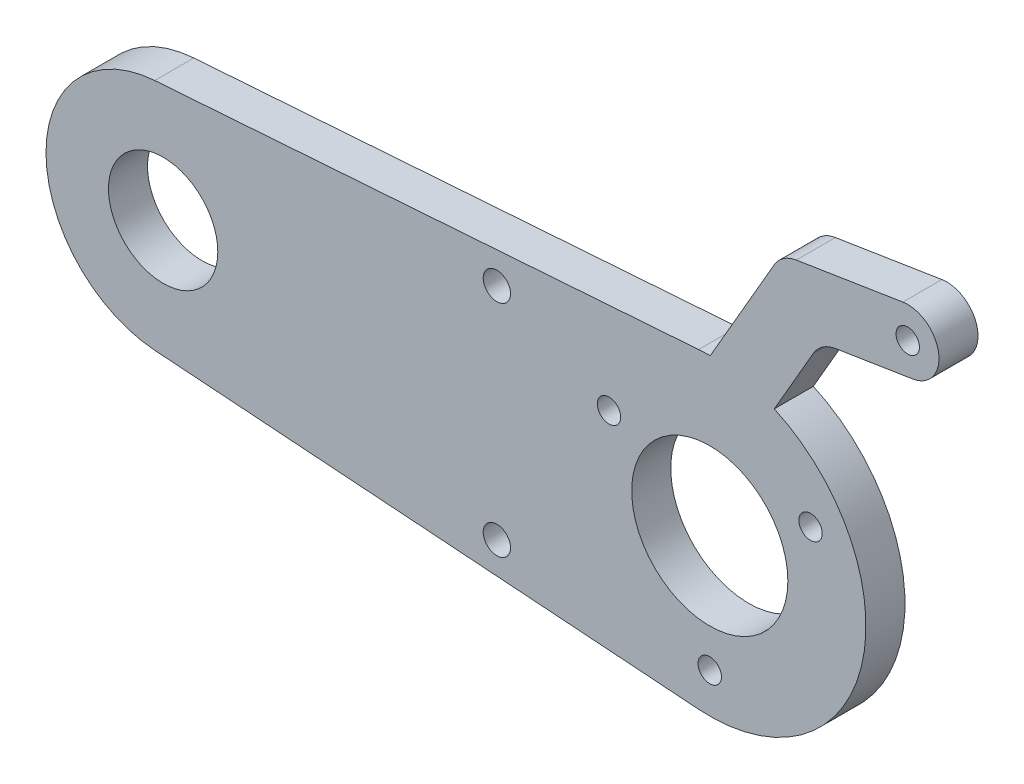
ISO-10303-21;
HEADER;
FILE_DESCRIPTION(('STEP AP214'),'2;1');
FILE_NAME('part.step','',(''),(''),'','','');
FILE_SCHEMA(('AUTOMOTIVE_DESIGN { 1 0 10303 214 1 1 1 1 }'));
ENDSEC;
DATA;
#1=APPLICATION_CONTEXT('core data for automotive mechanical design processes');
#2=APPLICATION_PROTOCOL_DEFINITION('international standard','automotive_design',2000,#1);
#3=PRODUCT_CONTEXT('',#1,'mechanical');
#4=PRODUCT('Part','Part','',(#3));
#5=PRODUCT_RELATED_PRODUCT_CATEGORY('part','',(#4));
#6=PRODUCT_DEFINITION_FORMATION('','',#4);
#7=PRODUCT_DEFINITION_CONTEXT('part definition',#1,'design');
#8=PRODUCT_DEFINITION('design','',#6,#7);
#9=PRODUCT_DEFINITION_SHAPE('','',#8);
#10=(LENGTH_UNIT() NAMED_UNIT(*) SI_UNIT(.MILLI.,.METRE.));
#11=(NAMED_UNIT(*) PLANE_ANGLE_UNIT() SI_UNIT($,.RADIAN.));
#12=(NAMED_UNIT(*) SI_UNIT($,.STERADIAN.) SOLID_ANGLE_UNIT());
#13=UNCERTAINTY_MEASURE_WITH_UNIT(LENGTH_MEASURE(1.E-05),#10,'distance_accuracy_value','');
#14=(GEOMETRIC_REPRESENTATION_CONTEXT(3) GLOBAL_UNCERTAINTY_ASSIGNED_CONTEXT((#13)) GLOBAL_UNIT_ASSIGNED_CONTEXT((#10,
#11,#12)) REPRESENTATION_CONTEXT('',''));
#15=CARTESIAN_POINT('',(0.,0.,0.));
#16=DIRECTION('',(0.,0.,1.));
#17=DIRECTION('',(1.,0.,0.));
#18=AXIS2_PLACEMENT_3D('',#15,#16,#17);
#19=CARTESIAN_POINT('',(0.,0.,-5.));
#20=DIRECTION('',(0.,0.,1.));
#21=DIRECTION('',(-1.,0.,0.));
#22=AXIS2_PLACEMENT_3D('',#19,#20,#21);
#23=PLANE('',#22);
#24=CARTESIAN_POINT('',(0.,0.,-5.));
#25=DIRECTION('',(0.,0.,1.));
#26=DIRECTION('',(-1.,0.,0.));
#27=AXIS2_PLACEMENT_3D('',#24,#25,#26);
#28=CIRCLE('',#27,20.);
#29=CARTESIAN_POINT('',(-1.42857142857143,-19.9489143482413,-5.));
#30=VERTEX_POINT('',#29);
#31=CARTESIAN_POINT('',(8.26328421639514,18.2131308115622,-5.));
#32=VERTEX_POINT('',#31);
#33=EDGE_CURVE('E189',#30,#32,#28,.T.);
#34=ORIENTED_EDGE('',*,*,#33,.F.);
#35=DIRECTION('',(0.997445717412067,-0.0714285714285714,0.));
#36=VECTOR('',#35,1.);
#37=CARTESIAN_POINT('',(-71.0714285714286,-14.961685761181,-5.));
#38=LINE('',#37,#36);
#39=CARTESIAN_POINT('',(-71.0714285714286,-14.961685761181,-5.));
#40=VERTEX_POINT('',#39);
#41=EDGE_CURVE('E151',#40,#30,#38,.T.);
#42=ORIENTED_EDGE('',*,*,#41,.F.);
#43=CARTESIAN_POINT('',(-70.,0.,-5.));
#44=DIRECTION('',(0.,0.,1.));
#45=DIRECTION('',(-1.,0.,0.));
#46=AXIS2_PLACEMENT_3D('',#43,#44,#45);
#47=CIRCLE('',#46,15.);
#48=CARTESIAN_POINT('',(-71.0714285714286,14.961685761181,-5.));
#49=VERTEX_POINT('',#48);
#50=EDGE_CURVE('E132',#49,#40,#47,.T.);
#51=ORIENTED_EDGE('',*,*,#50,.F.);
#52=DIRECTION('',(-0.997445717412067,-0.0714285714285714,0.));
#53=VECTOR('',#52,1.);
#54=CARTESIAN_POINT('',(-71.0714285714286,14.961685761181,-5.));
#55=LINE('',#54,#53);
#56=CARTESIAN_POINT('',(-1.42857142857143,19.9489143482413,-5.));
#57=VERTEX_POINT('',#56);
#58=EDGE_CURVE('E142',#57,#49,#55,.T.);
#59=ORIENTED_EDGE('',*,*,#58,.F.);
#60=CARTESIAN_POINT('',(0.,0.,-5.));
#61=DIRECTION('',(0.,0.,1.));
#62=DIRECTION('',(1.,0.,0.));
#63=AXIS2_PLACEMENT_3D('',#60,#61,#62);
#64=CIRCLE('',#63,20.);
#65=CARTESIAN_POINT('',(0.0572819558484061,19.9999179692701,-5.));
#66=VERTEX_POINT('',#65);
#67=EDGE_CURVE('E147',#66,#57,#64,.T.);
#68=ORIENTED_EDGE('',*,*,#67,.F.);
#69=DIRECTION('',(-0.499999999999994,-0.866025403784442,0.));
#70=VECTOR('',#69,1.);
#71=CARTESIAN_POINT('',(8.24298311691214,34.1779682758083,-5.));
#72=LINE('',#71,#70);
#73=CARTESIAN_POINT('',(8.24298311691214,34.1779682758083,-5.));
#74=VERTEX_POINT('',#73);
#75=EDGE_CURVE('E235',#74,#66,#72,.T.);
#76=ORIENTED_EDGE('',*,*,#75,.F.);
#77=CARTESIAN_POINT('',(11.7070847320499,32.1779682758083,-5.));
#78=DIRECTION('',(0.,0.,1.));
#79=DIRECTION('',(-1.,0.,0.));
#80=AXIS2_PLACEMENT_3D('',#77,#78,#79);
#81=CIRCLE('',#80,3.99999999999999);
#82=CARTESIAN_POINT('',(11.0813468718889,36.1287216381888,-5.));
#83=VERTEX_POINT('',#82);
#84=EDGE_CURVE('E232',#83,#74,#81,.T.);
#85=ORIENTED_EDGE('',*,*,#84,.F.);
#86=DIRECTION('',(-0.987688340595136,-0.156434465040244,0.));
#87=VECTOR('',#86,1.);
#88=CARTESIAN_POINT('',(11.0813468718889,36.1287216381888,-5.));
#89=LINE('',#88,#87);
#90=CARTESIAN_POINT('',(24.7270556570013,38.2899895869507,-5.));
#91=VERTEX_POINT('',#90);
#92=EDGE_CURVE('E229',#91,#83,#89,.T.);
#93=ORIENTED_EDGE('',*,*,#92,.F.);
#94=CARTESIAN_POINT('',(25.3527935171623,34.3392362245701,-5.));
#95=DIRECTION('',(0.,0.,1.));
#96=DIRECTION('',(1.,0.,0.));
#97=AXIS2_PLACEMENT_3D('',#94,#95,#96);
#98=CIRCLE('',#97,4.);
#99=CARTESIAN_POINT('',(25.9785313773232,30.3884828621896,-5.));
#100=VERTEX_POINT('',#99);
#101=EDGE_CURVE('E226',#100,#91,#98,.T.);
#102=ORIENTED_EDGE('',*,*,#101,.F.);
#103=DIRECTION('',(0.987688340595136,0.156434465040243,0.));
#104=VECTOR('',#103,1.);
#105=CARTESIAN_POINT('',(25.9785313773232,30.3884828621896,-5.));
#106=LINE('',#105,#104);
#107=CARTESIAN_POINT('',(16.1016479713719,28.8241382117871,-5.));
#108=VERTEX_POINT('',#107);
#109=EDGE_CURVE('E223',#108,#100,#106,.T.);
#110=ORIENTED_EDGE('',*,*,#109,.F.);
#111=CARTESIAN_POINT('',(16.7273858315328,24.8733848494066,-5.));
#112=DIRECTION('',(0.,0.,-1.));
#113=DIRECTION('',(1.,0.,0.));
#114=AXIS2_PLACEMENT_3D('',#111,#112,#113);
#115=CIRCLE('',#114,4.);
#116=CARTESIAN_POINT('',(13.2632842163951,26.8733848494066,-5.));
#117=VERTEX_POINT('',#116);
#118=EDGE_CURVE('E216',#117,#108,#115,.T.);
#119=ORIENTED_EDGE('',*,*,#118,.F.);
#120=DIRECTION('',(0.499999999999994,0.866025403784442,0.));
#121=VECTOR('',#120,1.);
#122=CARTESIAN_POINT('',(13.2632842163951,26.8733848494066,-5.));
#123=LINE('',#122,#121);
#124=EDGE_CURVE('E206',#32,#117,#123,.T.);
#125=ORIENTED_EDGE('',*,*,#124,.F.);
#126=EDGE_LOOP('',(#34,#42,#51,#59,#68,#76,#85,#93,#102,#110,#119,#125));
#127=FACE_BOUND('',#126,.T.);
#128=CARTESIAN_POINT('',(0.,0.,-5.));
#129=DIRECTION('',(0.,0.,1.));
#130=DIRECTION('',(1.,0.,0.));
#131=AXIS2_PLACEMENT_3D('',#128,#129,#130);
#132=CIRCLE('',#131,10.);
#133=CARTESIAN_POINT('',(10.,0.,-5.));
#134=VERTEX_POINT('',#133);
#135=EDGE_CURVE('E160',#134,#134,#132,.T.);
#136=ORIENTED_EDGE('',*,*,#135,.T.);
#137=EDGE_LOOP('',(#136));
#138=FACE_BOUND('',#137,.T.);
#139=CARTESIAN_POINT('',(-70.,0.,-5.));
#140=DIRECTION('',(0.,0.,1.));
#141=DIRECTION('',(1.,0.,0.));
#142=AXIS2_PLACEMENT_3D('',#139,#140,#141);
#143=CIRCLE('',#142,7.);
#144=CARTESIAN_POINT('',(-63.,0.,-5.));
#145=VERTEX_POINT('',#144);
#146=EDGE_CURVE('E493',#145,#145,#143,.T.);
#147=ORIENTED_EDGE('',*,*,#146,.T.);
#148=EDGE_LOOP('',(#147));
#149=FACE_BOUND('',#148,.T.);
#150=CARTESIAN_POINT('',(-12.9037785163881,7.45,-5.));
#151=DIRECTION('',(0.,0.,1.));
#152=DIRECTION('',(1.,0.,0.));
#153=AXIS2_PLACEMENT_3D('',#150,#151,#152);
#154=CIRCLE('',#153,1.5);
#155=CARTESIAN_POINT('',(-11.4037785163881,7.45,-5.));
#156=VERTEX_POINT('',#155);
#157=EDGE_CURVE('E487',#156,#156,#154,.T.);
#158=ORIENTED_EDGE('',*,*,#157,.T.);
#159=EDGE_LOOP('',(#158));
#160=FACE_BOUND('',#159,.T.);
#161=CARTESIAN_POINT('',(0.,-14.9000000000001,-5.));
#162=DIRECTION('',(0.,0.,1.));
#163=DIRECTION('',(1.,0.,0.));
#164=AXIS2_PLACEMENT_3D('',#161,#162,#163);
#165=CIRCLE('',#164,1.5);
#166=CARTESIAN_POINT('',(1.5,-14.9000000000001,-5.));
#167=VERTEX_POINT('',#166);
#168=EDGE_CURVE('E481',#167,#167,#165,.T.);
#169=ORIENTED_EDGE('',*,*,#168,.T.);
#170=EDGE_LOOP('',(#169));
#171=FACE_BOUND('',#170,.T.);
#172=CARTESIAN_POINT('',(12.9037785163882,7.44999999999981,-5.));
#173=DIRECTION('',(0.,0.,1.));
#174=DIRECTION('',(1.,0.,0.));
#175=AXIS2_PLACEMENT_3D('',#172,#173,#174);
#176=CIRCLE('',#175,1.5);
#177=CARTESIAN_POINT('',(14.4037785163882,7.44999999999981,-5.));
#178=VERTEX_POINT('',#177);
#179=EDGE_CURVE('E475',#178,#178,#176,.T.);
#180=ORIENTED_EDGE('',*,*,#179,.T.);
#181=EDGE_LOOP('',(#180));
#182=FACE_BOUND('',#181,.T.);
#183=CARTESIAN_POINT('',(-27.2623215608162,14.0886777814287,-5.));
#184=DIRECTION('',(0.,0.,1.));
#185=DIRECTION('',(1.,0.,0.));
#186=AXIS2_PLACEMENT_3D('',#183,#184,#185);
#187=CIRCLE('',#186,1.75);
#188=CARTESIAN_POINT('',(-25.5123215608162,14.0886777814287,-5.));
#189=VERTEX_POINT('',#188);
#190=EDGE_CURVE('E469',#189,#189,#187,.T.);
#191=ORIENTED_EDGE('',*,*,#190,.T.);
#192=EDGE_LOOP('',(#191));
#193=FACE_BOUND('',#192,.T.);
#194=CARTESIAN_POINT('',(-27.2623215608162,-14.0886777814287,-5.));
#195=DIRECTION('',(0.,0.,1.));
#196=DIRECTION('',(1.,0.,0.));
#197=AXIS2_PLACEMENT_3D('',#194,#195,#196);
#198=CIRCLE('',#197,1.75);
#199=CARTESIAN_POINT('',(-25.5123215608162,-14.0886777814287,-5.));
#200=VERTEX_POINT('',#199);
#201=EDGE_CURVE('E463',#200,#200,#198,.T.);
#202=ORIENTED_EDGE('',*,*,#201,.T.);
#203=EDGE_LOOP('',(#202));
#204=FACE_BOUND('',#203,.T.);
#205=CARTESIAN_POINT('',(25.3527935171623,34.3392362245701,-5.));
#206=DIRECTION('',(0.,0.,1.));
#207=DIRECTION('',(1.,0.,0.));
#208=AXIS2_PLACEMENT_3D('',#205,#206,#207);
#209=CIRCLE('',#208,1.5);
#210=CARTESIAN_POINT('',(26.8527935171623,34.3392362245701,-5.));
#211=VERTEX_POINT('',#210);
#212=EDGE_CURVE('E454',#211,#211,#209,.T.);
#213=ORIENTED_EDGE('',*,*,#212,.T.);
#214=EDGE_LOOP('',(#213));
#215=FACE_BOUND('',#214,.T.);
#216=ADVANCED_FACE('F35',(#127,#138,#149,#160,#171,#182,#193,#204,#215),#23,.F.);
#217=CARTESIAN_POINT('',(0.,0.,0.));
#218=DIRECTION('',(0.,0.,1.));
#219=DIRECTION('',(-1.,0.,0.));
#220=AXIS2_PLACEMENT_3D('',#217,#218,#219);
#221=PLANE('',#220);
#222=CARTESIAN_POINT('',(-27.2623215608162,-14.0886777814287,0.));
#223=DIRECTION('',(0.,0.,1.));
#224=DIRECTION('',(1.,0.,0.));
#225=AXIS2_PLACEMENT_3D('',#222,#223,#224);
#226=CIRCLE('',#225,1.75);
#227=CARTESIAN_POINT('',(-25.5123215608162,-14.0886777814287,0.));
#228=VERTEX_POINT('',#227);
#229=EDGE_CURVE('E460',#228,#228,#226,.T.);
#230=ORIENTED_EDGE('',*,*,#229,.F.);
#231=EDGE_LOOP('',(#230));
#232=FACE_BOUND('',#231,.T.);
#233=CARTESIAN_POINT('',(12.9037785163882,7.44999999999981,0.));
#234=DIRECTION('',(0.,0.,1.));
#235=DIRECTION('',(1.,0.,0.));
#236=AXIS2_PLACEMENT_3D('',#233,#234,#235);
#237=CIRCLE('',#236,1.5);
#238=CARTESIAN_POINT('',(14.4037785163882,7.44999999999981,0.));
#239=VERTEX_POINT('',#238);
#240=EDGE_CURVE('E472',#239,#239,#237,.T.);
#241=ORIENTED_EDGE('',*,*,#240,.F.);
#242=EDGE_LOOP('',(#241));
#243=FACE_BOUND('',#242,.T.);
#244=CARTESIAN_POINT('',(-12.9037785163881,7.45,0.));
#245=DIRECTION('',(0.,0.,1.));
#246=DIRECTION('',(1.,0.,0.));
#247=AXIS2_PLACEMENT_3D('',#244,#245,#246);
#248=CIRCLE('',#247,1.5);
#249=CARTESIAN_POINT('',(-11.4037785163881,7.45,0.));
#250=VERTEX_POINT('',#249);
#251=EDGE_CURVE('E484',#250,#250,#248,.T.);
#252=ORIENTED_EDGE('',*,*,#251,.F.);
#253=EDGE_LOOP('',(#252));
#254=FACE_BOUND('',#253,.T.);
#255=CARTESIAN_POINT('',(0.,0.,0.));
#256=DIRECTION('',(0.,0.,1.));
#257=DIRECTION('',(1.,0.,0.));
#258=AXIS2_PLACEMENT_3D('',#255,#256,#257);
#259=CIRCLE('',#258,10.);
#260=CARTESIAN_POINT('',(10.,0.,0.));
#261=VERTEX_POINT('',#260);
#262=EDGE_CURVE('E219',#261,#261,#259,.T.);
#263=ORIENTED_EDGE('',*,*,#262,.F.);
#264=EDGE_LOOP('',(#263));
#265=FACE_BOUND('',#264,.T.);
#266=CARTESIAN_POINT('',(0.,0.,0.));
#267=DIRECTION('',(0.,0.,1.));
#268=DIRECTION('',(-1.,0.,0.));
#269=AXIS2_PLACEMENT_3D('',#266,#267,#268);
#270=CIRCLE('',#269,20.);
#271=CARTESIAN_POINT('',(-1.42857142857143,-19.9489143482413,0.));
#272=VERTEX_POINT('',#271);
#273=CARTESIAN_POINT('',(8.26328421639514,18.2131308115622,0.));
#274=VERTEX_POINT('',#273);
#275=EDGE_CURVE('E156',#272,#274,#270,.T.);
#276=ORIENTED_EDGE('',*,*,#275,.T.);
#277=DIRECTION('',(0.499999999999994,0.866025403784442,0.));
#278=VECTOR('',#277,1.);
#279=CARTESIAN_POINT('',(13.2632842163951,26.8733848494066,0.));
#280=LINE('',#279,#278);
#281=CARTESIAN_POINT('',(13.2632842163951,26.8733848494066,0.));
#282=VERTEX_POINT('',#281);
#283=EDGE_CURVE('E159',#274,#282,#280,.T.);
#284=ORIENTED_EDGE('',*,*,#283,.T.);
#285=CARTESIAN_POINT('',(16.7273858315328,24.8733848494066,0.));
#286=DIRECTION('',(0.,0.,-1.));
#287=DIRECTION('',(1.,0.,0.));
#288=AXIS2_PLACEMENT_3D('',#285,#286,#287);
#289=CIRCLE('',#288,4.);
#290=CARTESIAN_POINT('',(16.1016479713719,28.8241382117871,0.));
#291=VERTEX_POINT('',#290);
#292=EDGE_CURVE('E163',#282,#291,#289,.T.);
#293=ORIENTED_EDGE('',*,*,#292,.T.);
#294=DIRECTION('',(0.987688340595136,0.156434465040243,0.));
#295=VECTOR('',#294,1.);
#296=CARTESIAN_POINT('',(25.9785313773232,30.3884828621896,0.));
#297=LINE('',#296,#295);
#298=CARTESIAN_POINT('',(25.9785313773232,30.3884828621896,0.));
#299=VERTEX_POINT('',#298);
#300=EDGE_CURVE('E166',#291,#299,#297,.T.);
#301=ORIENTED_EDGE('',*,*,#300,.T.);
#302=CARTESIAN_POINT('',(25.3527935171623,34.3392362245701,0.));
#303=DIRECTION('',(0.,0.,1.));
#304=DIRECTION('',(1.,0.,0.));
#305=AXIS2_PLACEMENT_3D('',#302,#303,#304);
#306=CIRCLE('',#305,4.);
#307=CARTESIAN_POINT('',(24.7270556570013,38.2899895869507,0.));
#308=VERTEX_POINT('',#307);
#309=EDGE_CURVE('E169',#299,#308,#306,.T.);
#310=ORIENTED_EDGE('',*,*,#309,.T.);
#311=DIRECTION('',(-0.987688340595136,-0.156434465040244,0.));
#312=VECTOR('',#311,1.);
#313=CARTESIAN_POINT('',(11.0813468718889,36.1287216381888,0.));
#314=LINE('',#313,#312);
#315=CARTESIAN_POINT('',(11.0813468718889,36.1287216381888,0.));
#316=VERTEX_POINT('',#315);
#317=EDGE_CURVE('E172',#308,#316,#314,.T.);
#318=ORIENTED_EDGE('',*,*,#317,.T.);
#319=CARTESIAN_POINT('',(11.7070847320499,32.1779682758083,0.));
#320=DIRECTION('',(0.,0.,1.));
#321=DIRECTION('',(-1.,0.,0.));
#322=AXIS2_PLACEMENT_3D('',#319,#320,#321);
#323=CIRCLE('',#322,3.99999999999999);
#324=CARTESIAN_POINT('',(8.24298311691214,34.1779682758083,0.));
#325=VERTEX_POINT('',#324);
#326=EDGE_CURVE('E175',#316,#325,#323,.T.);
#327=ORIENTED_EDGE('',*,*,#326,.T.);
#328=DIRECTION('',(-0.499999999999994,-0.866025403784442,0.));
#329=VECTOR('',#328,1.);
#330=CARTESIAN_POINT('',(8.24298311691214,34.1779682758083,0.));
#331=LINE('',#330,#329);
#332=CARTESIAN_POINT('',(0.0572819558484061,19.9999179692701,0.));
#333=VERTEX_POINT('',#332);
#334=EDGE_CURVE('E178',#325,#333,#331,.T.);
#335=ORIENTED_EDGE('',*,*,#334,.T.);
#336=CARTESIAN_POINT('',(0.,0.,0.));
#337=DIRECTION('',(0.,0.,1.));
#338=DIRECTION('',(1.,0.,0.));
#339=AXIS2_PLACEMENT_3D('',#336,#337,#338);
#340=CIRCLE('',#339,20.);
#341=CARTESIAN_POINT('',(-1.42857142857143,19.9489143482413,0.));
#342=VERTEX_POINT('',#341);
#343=EDGE_CURVE('E181',#333,#342,#340,.T.);
#344=ORIENTED_EDGE('',*,*,#343,.T.);
#345=DIRECTION('',(-0.997445717412067,-0.0714285714285714,0.));
#346=VECTOR('',#345,1.);
#347=CARTESIAN_POINT('',(-71.0714285714286,14.961685761181,0.));
#348=LINE('',#347,#346);
#349=CARTESIAN_POINT('',(-71.0714285714286,14.961685761181,0.));
#350=VERTEX_POINT('',#349);
#351=EDGE_CURVE('E184',#342,#350,#348,.T.);
#352=ORIENTED_EDGE('',*,*,#351,.T.);
#353=CARTESIAN_POINT('',(-70.,0.,0.));
#354=DIRECTION('',(0.,0.,1.));
#355=DIRECTION('',(-1.,0.,0.));
#356=AXIS2_PLACEMENT_3D('',#353,#354,#355);
#357=CIRCLE('',#356,15.);
#358=CARTESIAN_POINT('',(-71.0714285714286,-14.961685761181,0.));
#359=VERTEX_POINT('',#358);
#360=EDGE_CURVE('E135',#350,#359,#357,.T.);
#361=ORIENTED_EDGE('',*,*,#360,.T.);
#362=DIRECTION('',(0.997445717412067,-0.0714285714285714,0.));
#363=VECTOR('',#362,1.);
#364=CARTESIAN_POINT('',(-71.0714285714286,-14.961685761181,0.));
#365=LINE('',#364,#363);
#366=EDGE_CURVE('E187',#359,#272,#365,.T.);
#367=ORIENTED_EDGE('',*,*,#366,.T.);
#368=EDGE_LOOP('',(#276,#284,#293,#301,#310,#318,#327,#335,#344,#352,#361,#367));
#369=FACE_BOUND('',#368,.T.);
#370=CARTESIAN_POINT('',(-70.,0.,0.));
#371=DIRECTION('',(0.,0.,1.));
#372=DIRECTION('',(1.,0.,0.));
#373=AXIS2_PLACEMENT_3D('',#370,#371,#372);
#374=CIRCLE('',#373,7.);
#375=CARTESIAN_POINT('',(-63.,0.,0.));
#376=VERTEX_POINT('',#375);
#377=EDGE_CURVE('E490',#376,#376,#374,.T.);
#378=ORIENTED_EDGE('',*,*,#377,.F.);
#379=EDGE_LOOP('',(#378));
#380=FACE_BOUND('',#379,.T.);
#381=CARTESIAN_POINT('',(0.,-14.9000000000001,0.));
#382=DIRECTION('',(0.,0.,1.));
#383=DIRECTION('',(1.,0.,0.));
#384=AXIS2_PLACEMENT_3D('',#381,#382,#383);
#385=CIRCLE('',#384,1.5);
#386=CARTESIAN_POINT('',(1.5,-14.9000000000001,0.));
#387=VERTEX_POINT('',#386);
#388=EDGE_CURVE('E478',#387,#387,#385,.T.);
#389=ORIENTED_EDGE('',*,*,#388,.F.);
#390=EDGE_LOOP('',(#389));
#391=FACE_BOUND('',#390,.T.);
#392=CARTESIAN_POINT('',(-27.2623215608162,14.0886777814287,0.));
#393=DIRECTION('',(0.,0.,1.));
#394=DIRECTION('',(1.,0.,0.));
#395=AXIS2_PLACEMENT_3D('',#392,#393,#394);
#396=CIRCLE('',#395,1.75);
#397=CARTESIAN_POINT('',(-25.5123215608162,14.0886777814287,0.));
#398=VERTEX_POINT('',#397);
#399=EDGE_CURVE('E466',#398,#398,#396,.T.);
#400=ORIENTED_EDGE('',*,*,#399,.F.);
#401=EDGE_LOOP('',(#400));
#402=FACE_BOUND('',#401,.T.);
#403=CARTESIAN_POINT('',(25.3527935171623,34.3392362245701,0.));
#404=DIRECTION('',(0.,0.,1.));
#405=DIRECTION('',(1.,0.,0.));
#406=AXIS2_PLACEMENT_3D('',#403,#404,#405);
#407=CIRCLE('',#406,1.5);
#408=CARTESIAN_POINT('',(26.8527935171623,34.3392362245701,0.));
#409=VERTEX_POINT('',#408);
#410=EDGE_CURVE('E457',#409,#409,#407,.T.);
#411=ORIENTED_EDGE('',*,*,#410,.F.);
#412=EDGE_LOOP('',(#411));
#413=FACE_BOUND('',#412,.T.);
#414=ADVANCED_FACE('F213',(#232,#243,#254,#265,#369,#380,#391,#402,#413),#221,.T.);
#415=CARTESIAN_POINT('',(0.,0.,-5.));
#416=DIRECTION('',(0.,0.,1.));
#417=DIRECTION('',(-1.,0.,0.));
#418=AXIS2_PLACEMENT_3D('',#415,#416,#417);
#419=CYLINDRICAL_SURFACE('',#418,20.);
#420=ORIENTED_EDGE('',*,*,#275,.F.);
#421=DIRECTION('',(0.,0.,1.));
#422=VECTOR('',#421,1.);
#423=CARTESIAN_POINT('',(-1.42857142857143,-19.9489143482413,-5.));
#424=LINE('',#423,#422);
#425=EDGE_CURVE('E52',#30,#272,#424,.T.);
#426=ORIENTED_EDGE('',*,*,#425,.F.);
#427=ORIENTED_EDGE('',*,*,#33,.T.);
#428=DIRECTION('',(0.,0.,1.));
#429=VECTOR('',#428,1.);
#430=CARTESIAN_POINT('',(8.26328421639514,18.2131308115622,-5.));
#431=LINE('',#430,#429);
#432=EDGE_CURVE('E11',#32,#274,#431,.T.);
#433=ORIENTED_EDGE('',*,*,#432,.T.);
#434=EDGE_LOOP('',(#420,#426,#427,#433));
#435=FACE_BOUND('',#434,.T.);
#436=ADVANCED_FACE('F37',(#435),#419,.T.);
#437=CARTESIAN_POINT('',(13.2632842163951,26.8733848494066,-5.));
#438=DIRECTION('',(-0.866025403784442,0.499999999999994,0.));
#439=DIRECTION('',(-0.499999999999994,-0.866025403784442,0.));
#440=AXIS2_PLACEMENT_3D('',#437,#438,#439);
#441=PLANE('',#440);
#442=ORIENTED_EDGE('',*,*,#283,.F.);
#443=ORIENTED_EDGE('',*,*,#432,.F.);
#444=ORIENTED_EDGE('',*,*,#124,.T.);
#445=DIRECTION('',(0.,0.,1.));
#446=VECTOR('',#445,1.);
#447=CARTESIAN_POINT('',(13.2632842163951,26.8733848494066,-5.));
#448=LINE('',#447,#446);
#449=EDGE_CURVE('E44',#117,#282,#448,.T.);
#450=ORIENTED_EDGE('',*,*,#449,.T.);
#451=EDGE_LOOP('',(#442,#443,#444,#450));
#452=FACE_BOUND('',#451,.T.);
#453=ADVANCED_FACE('F205',(#452),#441,.F.);
#454=CARTESIAN_POINT('',(16.7273858315328,24.8733848494066,-5.));
#455=DIRECTION('',(0.,0.,1.));
#456=DIRECTION('',(-1.,0.,0.));
#457=AXIS2_PLACEMENT_3D('',#454,#455,#456);
#458=CYLINDRICAL_SURFACE('',#457,4.);
#459=ORIENTED_EDGE('',*,*,#292,.F.);
#460=ORIENTED_EDGE('',*,*,#449,.F.);
#461=ORIENTED_EDGE('',*,*,#118,.T.);
#462=DIRECTION('',(0.,0.,1.));
#463=VECTOR('',#462,1.);
#464=CARTESIAN_POINT('',(16.1016479713719,28.8241382117871,-5.));
#465=LINE('',#464,#463);
#466=EDGE_CURVE('E203',#108,#291,#465,.T.);
#467=ORIENTED_EDGE('',*,*,#466,.T.);
#468=EDGE_LOOP('',(#459,#460,#461,#467));
#469=FACE_BOUND('',#468,.T.);
#470=ADVANCED_FACE('F210',(#469),#458,.F.);
#471=CARTESIAN_POINT('',(25.9785313773232,30.3884828621896,-5.));
#472=DIRECTION('',(-0.156434465040243,0.987688340595136,0.));
#473=DIRECTION('',(-0.987688340595136,-0.156434465040243,0.));
#474=AXIS2_PLACEMENT_3D('',#471,#472,#473);
#475=PLANE('',#474);
#476=ORIENTED_EDGE('',*,*,#300,.F.);
#477=ORIENTED_EDGE('',*,*,#466,.F.);
#478=ORIENTED_EDGE('',*,*,#109,.T.);
#479=DIRECTION('',(0.,0.,1.));
#480=VECTOR('',#479,1.);
#481=CARTESIAN_POINT('',(25.9785313773232,30.3884828621896,-5.));
#482=LINE('',#481,#480);
#483=EDGE_CURVE('E201',#100,#299,#482,.T.);
#484=ORIENTED_EDGE('',*,*,#483,.T.);
#485=EDGE_LOOP('',(#476,#477,#478,#484));
#486=FACE_BOUND('',#485,.T.);
#487=ADVANCED_FACE('F258',(#486),#475,.F.);
#488=CARTESIAN_POINT('',(25.3527935171623,34.3392362245701,-5.));
#489=DIRECTION('',(0.,0.,1.));
#490=DIRECTION('',(-1.,0.,0.));
#491=AXIS2_PLACEMENT_3D('',#488,#489,#490);
#492=CYLINDRICAL_SURFACE('',#491,4.);
#493=ORIENTED_EDGE('',*,*,#309,.F.);
#494=ORIENTED_EDGE('',*,*,#483,.F.);
#495=ORIENTED_EDGE('',*,*,#101,.T.);
#496=DIRECTION('',(0.,0.,1.));
#497=VECTOR('',#496,1.);
#498=CARTESIAN_POINT('',(24.7270556570013,38.2899895869507,-5.));
#499=LINE('',#498,#497);
#500=EDGE_CURVE('E199',#91,#308,#499,.T.);
#501=ORIENTED_EDGE('',*,*,#500,.T.);
#502=EDGE_LOOP('',(#493,#494,#495,#501));
#503=FACE_BOUND('',#502,.T.);
#504=ADVANCED_FACE('F256',(#503),#492,.T.);
#505=CARTESIAN_POINT('',(11.0813468718889,36.1287216381888,-5.));
#506=DIRECTION('',(0.156434465040244,-0.987688340595136,0.));
#507=DIRECTION('',(0.987688340595136,0.156434465040244,0.));
#508=AXIS2_PLACEMENT_3D('',#505,#506,#507);
#509=PLANE('',#508);
#510=ORIENTED_EDGE('',*,*,#317,.F.);
#511=ORIENTED_EDGE('',*,*,#500,.F.);
#512=ORIENTED_EDGE('',*,*,#92,.T.);
#513=DIRECTION('',(0.,0.,1.));
#514=VECTOR('',#513,1.);
#515=CARTESIAN_POINT('',(11.0813468718889,36.1287216381888,-5.));
#516=LINE('',#515,#514);
#517=EDGE_CURVE('E197',#83,#316,#516,.T.);
#518=ORIENTED_EDGE('',*,*,#517,.T.);
#519=EDGE_LOOP('',(#510,#511,#512,#518));
#520=FACE_BOUND('',#519,.T.);
#521=ADVANCED_FACE('F251',(#520),#509,.F.);
#522=CARTESIAN_POINT('',(11.7070847320499,32.1779682758083,-5.));
#523=DIRECTION('',(0.,0.,1.));
#524=DIRECTION('',(-1.,0.,0.));
#525=AXIS2_PLACEMENT_3D('',#522,#523,#524);
#526=CYLINDRICAL_SURFACE('',#525,3.99999999999999);
#527=ORIENTED_EDGE('',*,*,#326,.F.);
#528=ORIENTED_EDGE('',*,*,#517,.F.);
#529=ORIENTED_EDGE('',*,*,#84,.T.);
#530=DIRECTION('',(0.,0.,1.));
#531=VECTOR('',#530,1.);
#532=CARTESIAN_POINT('',(8.24298311691214,34.1779682758083,-5.));
#533=LINE('',#532,#531);
#534=EDGE_CURVE('E195',#74,#325,#533,.T.);
#535=ORIENTED_EDGE('',*,*,#534,.T.);
#536=EDGE_LOOP('',(#527,#528,#529,#535));
#537=FACE_BOUND('',#536,.T.);
#538=ADVANCED_FACE('F248',(#537),#526,.T.);
#539=CARTESIAN_POINT('',(8.24298311691214,34.1779682758083,-5.));
#540=DIRECTION('',(0.866025403784442,-0.499999999999994,0.));
#541=DIRECTION('',(0.499999999999994,0.866025403784442,0.));
#542=AXIS2_PLACEMENT_3D('',#539,#540,#541);
#543=PLANE('',#542);
#544=ORIENTED_EDGE('',*,*,#334,.F.);
#545=ORIENTED_EDGE('',*,*,#534,.F.);
#546=ORIENTED_EDGE('',*,*,#75,.T.);
#547=DIRECTION('',(0.,0.,1.));
#548=VECTOR('',#547,1.);
#549=CARTESIAN_POINT('',(0.0572819558484061,19.9999179692701,-5.));
#550=LINE('',#549,#548);
#551=EDGE_CURVE('E193',#66,#333,#550,.T.);
#552=ORIENTED_EDGE('',*,*,#551,.T.);
#553=EDGE_LOOP('',(#544,#545,#546,#552));
#554=FACE_BOUND('',#553,.T.);
#555=ADVANCED_FACE('F245',(#554),#543,.F.);
#556=CARTESIAN_POINT('',(0.,0.,-5.));
#557=DIRECTION('',(0.,0.,1.));
#558=DIRECTION('',(-1.,0.,0.));
#559=AXIS2_PLACEMENT_3D('',#556,#557,#558);
#560=CYLINDRICAL_SURFACE('',#559,20.);
#561=ORIENTED_EDGE('',*,*,#343,.F.);
#562=ORIENTED_EDGE('',*,*,#551,.F.);
#563=ORIENTED_EDGE('',*,*,#67,.T.);
#564=DIRECTION('',(0.,0.,1.));
#565=VECTOR('',#564,1.);
#566=CARTESIAN_POINT('',(-1.42857142857143,19.9489143482413,-5.));
#567=LINE('',#566,#565);
#568=EDGE_CURVE('E139',#57,#342,#567,.T.);
#569=ORIENTED_EDGE('',*,*,#568,.T.);
#570=EDGE_LOOP('',(#561,#562,#563,#569));
#571=FACE_BOUND('',#570,.T.);
#572=ADVANCED_FACE('F239',(#571),#560,.T.);
#573=CARTESIAN_POINT('',(-71.0714285714286,14.961685761181,-5.));
#574=DIRECTION('',(0.0714285714285714,-0.997445717412067,0.));
#575=DIRECTION('',(0.997445717412067,0.0714285714285714,0.));
#576=AXIS2_PLACEMENT_3D('',#573,#574,#575);
#577=PLANE('',#576);
#578=ORIENTED_EDGE('',*,*,#351,.F.);
#579=ORIENTED_EDGE('',*,*,#568,.F.);
#580=ORIENTED_EDGE('',*,*,#58,.T.);
#581=DIRECTION('',(0.,0.,1.));
#582=VECTOR('',#581,1.);
#583=CARTESIAN_POINT('',(-71.0714285714286,14.961685761181,-5.));
#584=LINE('',#583,#582);
#585=EDGE_CURVE('E128',#49,#350,#584,.T.);
#586=ORIENTED_EDGE('',*,*,#585,.T.);
#587=EDGE_LOOP('',(#578,#579,#580,#586));
#588=FACE_BOUND('',#587,.T.);
#589=ADVANCED_FACE('F143',(#588),#577,.F.);
#590=CARTESIAN_POINT('',(-70.,0.,-5.));
#591=DIRECTION('',(0.,0.,1.));
#592=DIRECTION('',(-1.,0.,0.));
#593=AXIS2_PLACEMENT_3D('',#590,#591,#592);
#594=CYLINDRICAL_SURFACE('',#593,15.);
#595=ORIENTED_EDGE('',*,*,#360,.F.);
#596=ORIENTED_EDGE('',*,*,#585,.F.);
#597=ORIENTED_EDGE('',*,*,#50,.T.);
#598=DIRECTION('',(0.,0.,1.));
#599=VECTOR('',#598,1.);
#600=CARTESIAN_POINT('',(-71.0714285714286,-14.961685761181,-5.));
#601=LINE('',#600,#599);
#602=EDGE_CURVE('E92',#40,#359,#601,.T.);
#603=ORIENTED_EDGE('',*,*,#602,.T.);
#604=EDGE_LOOP('',(#595,#596,#597,#603));
#605=FACE_BOUND('',#604,.T.);
#606=ADVANCED_FACE('F130',(#605),#594,.T.);
#607=CARTESIAN_POINT('',(-71.0714285714286,-14.961685761181,-5.));
#608=DIRECTION('',(0.0714285714285714,0.997445717412067,0.));
#609=DIRECTION('',(-0.997445717412067,0.0714285714285714,0.));
#610=AXIS2_PLACEMENT_3D('',#607,#608,#609);
#611=PLANE('',#610);
#612=ORIENTED_EDGE('',*,*,#366,.F.);
#613=ORIENTED_EDGE('',*,*,#602,.F.);
#614=ORIENTED_EDGE('',*,*,#41,.T.);
#615=ORIENTED_EDGE('',*,*,#425,.T.);
#616=EDGE_LOOP('',(#612,#613,#614,#615));
#617=FACE_BOUND('',#616,.T.);
#618=ADVANCED_FACE('F278',(#617),#611,.F.);
#619=CARTESIAN_POINT('',(0.,0.,-5.));
#620=DIRECTION('',(0.,0.,1.));
#621=DIRECTION('',(-1.,0.,0.));
#622=AXIS2_PLACEMENT_3D('',#619,#620,#621);
#623=CYLINDRICAL_SURFACE('',#622,10.);
#624=ORIENTED_EDGE('',*,*,#135,.F.);
#625=EDGE_LOOP('',(#624));
#626=FACE_BOUND('',#625,.T.);
#627=ORIENTED_EDGE('',*,*,#262,.T.);
#628=EDGE_LOOP('',(#627));
#629=FACE_BOUND('',#628,.T.);
#630=ADVANCED_FACE('F275',(#626,#629),#623,.F.);
#631=CARTESIAN_POINT('',(-70.,0.,-5.));
#632=DIRECTION('',(0.,0.,1.));
#633=DIRECTION('',(-1.,0.,0.));
#634=AXIS2_PLACEMENT_3D('',#631,#632,#633);
#635=CYLINDRICAL_SURFACE('',#634,7.);
#636=ORIENTED_EDGE('',*,*,#146,.F.);
#637=EDGE_LOOP('',(#636));
#638=FACE_BOUND('',#637,.T.);
#639=ORIENTED_EDGE('',*,*,#377,.T.);
#640=EDGE_LOOP('',(#639));
#641=FACE_BOUND('',#640,.T.);
#642=ADVANCED_FACE('F326',(#638,#641),#635,.F.);
#643=CARTESIAN_POINT('',(-12.9037785163881,7.45,-5.));
#644=DIRECTION('',(0.,0.,1.));
#645=DIRECTION('',(-1.,0.,0.));
#646=AXIS2_PLACEMENT_3D('',#643,#644,#645);
#647=CYLINDRICAL_SURFACE('',#646,1.5);
#648=ORIENTED_EDGE('',*,*,#157,.F.);
#649=EDGE_LOOP('',(#648));
#650=FACE_BOUND('',#649,.T.);
#651=ORIENTED_EDGE('',*,*,#251,.T.);
#652=EDGE_LOOP('',(#651));
#653=FACE_BOUND('',#652,.T.);
#654=ADVANCED_FACE('F333',(#650,#653),#647,.F.);
#655=CARTESIAN_POINT('',(0.,-14.9000000000001,-5.));
#656=DIRECTION('',(0.,0.,1.));
#657=DIRECTION('',(-1.,0.,0.));
#658=AXIS2_PLACEMENT_3D('',#655,#656,#657);
#659=CYLINDRICAL_SURFACE('',#658,1.5);
#660=ORIENTED_EDGE('',*,*,#168,.F.);
#661=EDGE_LOOP('',(#660));
#662=FACE_BOUND('',#661,.T.);
#663=ORIENTED_EDGE('',*,*,#388,.T.);
#664=EDGE_LOOP('',(#663));
#665=FACE_BOUND('',#664,.T.);
#666=ADVANCED_FACE('F340',(#662,#665),#659,.F.);
#667=CARTESIAN_POINT('',(12.9037785163882,7.44999999999981,-5.));
#668=DIRECTION('',(0.,0.,1.));
#669=DIRECTION('',(-1.,0.,0.));
#670=AXIS2_PLACEMENT_3D('',#667,#668,#669);
#671=CYLINDRICAL_SURFACE('',#670,1.5);
#672=ORIENTED_EDGE('',*,*,#179,.F.);
#673=EDGE_LOOP('',(#672));
#674=FACE_BOUND('',#673,.T.);
#675=ORIENTED_EDGE('',*,*,#240,.T.);
#676=EDGE_LOOP('',(#675));
#677=FACE_BOUND('',#676,.T.);
#678=ADVANCED_FACE('F348',(#674,#677),#671,.F.);
#679=CARTESIAN_POINT('',(-27.2623215608162,14.0886777814287,-5.));
#680=DIRECTION('',(0.,0.,1.));
#681=DIRECTION('',(-1.,0.,0.));
#682=AXIS2_PLACEMENT_3D('',#679,#680,#681);
#683=CYLINDRICAL_SURFACE('',#682,1.75);
#684=ORIENTED_EDGE('',*,*,#190,.F.);
#685=EDGE_LOOP('',(#684));
#686=FACE_BOUND('',#685,.T.);
#687=ORIENTED_EDGE('',*,*,#399,.T.);
#688=EDGE_LOOP('',(#687));
#689=FACE_BOUND('',#688,.T.);
#690=ADVANCED_FACE('F356',(#686,#689),#683,.F.);
#691=CARTESIAN_POINT('',(-27.2623215608162,-14.0886777814287,-5.));
#692=DIRECTION('',(0.,0.,1.));
#693=DIRECTION('',(-1.,0.,0.));
#694=AXIS2_PLACEMENT_3D('',#691,#692,#693);
#695=CYLINDRICAL_SURFACE('',#694,1.75);
#696=ORIENTED_EDGE('',*,*,#201,.F.);
#697=EDGE_LOOP('',(#696));
#698=FACE_BOUND('',#697,.T.);
#699=ORIENTED_EDGE('',*,*,#229,.T.);
#700=EDGE_LOOP('',(#699));
#701=FACE_BOUND('',#700,.T.);
#702=ADVANCED_FACE('F364',(#698,#701),#695,.F.);
#703=CARTESIAN_POINT('',(25.3527935171623,34.3392362245701,-5.));
#704=DIRECTION('',(0.,0.,1.));
#705=DIRECTION('',(-1.,0.,0.));
#706=AXIS2_PLACEMENT_3D('',#703,#704,#705);
#707=CYLINDRICAL_SURFACE('',#706,1.5);
#708=ORIENTED_EDGE('',*,*,#212,.F.);
#709=EDGE_LOOP('',(#708));
#710=FACE_BOUND('',#709,.T.);
#711=ORIENTED_EDGE('',*,*,#410,.T.);
#712=EDGE_LOOP('',(#711));
#713=FACE_BOUND('',#712,.T.);
#714=ADVANCED_FACE('F372',(#710,#713),#707,.F.);
#715=CLOSED_SHELL('',(#216,#414,#436,#453,#470,#487,#504,#521,#538,#555,#572,#589,#606,#618,
#630,#642,#654,#666,#678,#690,#702,#714));
#716=MANIFOLD_SOLID_BREP('B2',#715);
#717=ADVANCED_BREP_SHAPE_REPRESENTATION('',(#18,#716),#14);
#718=SHAPE_DEFINITION_REPRESENTATION(#9,#717);
ENDSEC;
END-ISO-10303-21;
